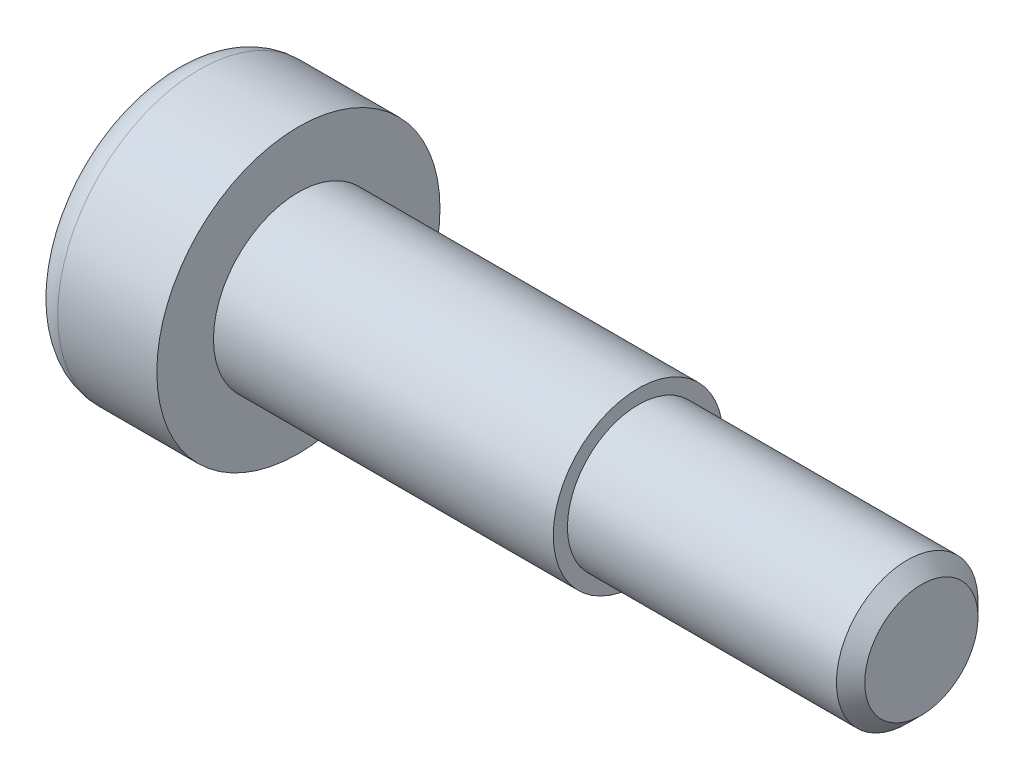
ISO-10303-21;
HEADER;
FILE_DESCRIPTION(('STEP AP214'),'2;1');
FILE_NAME('part.step','',(''),(''),'','','');
FILE_SCHEMA(('AUTOMOTIVE_DESIGN { 1 0 10303 214 1 1 1 1 }'));
ENDSEC;
DATA;
#1=APPLICATION_CONTEXT('core data for automotive mechanical design processes');
#2=APPLICATION_PROTOCOL_DEFINITION('international standard','automotive_design',2000,#1);
#3=PRODUCT_CONTEXT('',#1,'mechanical');
#4=PRODUCT('Part','Part','',(#3));
#5=PRODUCT_RELATED_PRODUCT_CATEGORY('part','',(#4));
#6=PRODUCT_DEFINITION_FORMATION('','',#4);
#7=PRODUCT_DEFINITION_CONTEXT('part definition',#1,'design');
#8=PRODUCT_DEFINITION('design','',#6,#7);
#9=PRODUCT_DEFINITION_SHAPE('','',#8);
#10=(LENGTH_UNIT() NAMED_UNIT(*) SI_UNIT(.MILLI.,.METRE.));
#11=(NAMED_UNIT(*) PLANE_ANGLE_UNIT() SI_UNIT($,.RADIAN.));
#12=(NAMED_UNIT(*) SI_UNIT($,.STERADIAN.) SOLID_ANGLE_UNIT());
#13=UNCERTAINTY_MEASURE_WITH_UNIT(LENGTH_MEASURE(1.E-05),#10,'distance_accuracy_value','');
#14=(GEOMETRIC_REPRESENTATION_CONTEXT(3) GLOBAL_UNCERTAINTY_ASSIGNED_CONTEXT((#13)) GLOBAL_UNIT_ASSIGNED_CONTEXT((#10,
#11,#12)) REPRESENTATION_CONTEXT('',''));
#15=CARTESIAN_POINT('',(0.,0.,0.));
#16=DIRECTION('',(0.,0.,1.));
#17=DIRECTION('',(1.,0.,0.));
#18=AXIS2_PLACEMENT_3D('',#15,#16,#17);
#19=CARTESIAN_POINT('',(0.,0.,0.));
#20=DIRECTION('',(1.,0.,0.));
#21=DIRECTION('',(0.,0.,-1.));
#22=AXIS2_PLACEMENT_3D('',#19,#20,#21);
#23=PLANE('',#22);
#24=CARTESIAN_POINT('',(0.,0.,0.));
#25=DIRECTION('',(1.,0.,0.));
#26=DIRECTION('',(0.,0.,-1.));
#27=AXIS2_PLACEMENT_3D('',#24,#25,#26);
#28=CIRCLE('',#27,4.);
#29=CARTESIAN_POINT('',(0.,0.,-4.));
#30=VERTEX_POINT('',#29);
#31=EDGE_CURVE('E156',#30,#30,#28,.F.);
#32=ORIENTED_EDGE('',*,*,#31,.T.);
#33=EDGE_LOOP('',(#32));
#34=FACE_BOUND('',#33,.T.);
#35=DIRECTION('',(0.,-0.5,-0.866025403784439));
#36=VECTOR('',#35,1.);
#37=CARTESIAN_POINT('',(0.,1.73205080756888,0.));
#38=LINE('',#37,#36);
#39=CARTESIAN_POINT('',(0.,1.73205080756888,0.));
#40=VERTEX_POINT('',#39);
#41=CARTESIAN_POINT('',(0.,0.866025403784439,-1.5));
#42=VERTEX_POINT('',#41);
#43=EDGE_CURVE('E126',#40,#42,#38,.T.);
#44=ORIENTED_EDGE('',*,*,#43,.F.);
#45=DIRECTION('',(0.,0.5,-0.866025403784439));
#46=VECTOR('',#45,1.);
#47=CARTESIAN_POINT('',(0.,0.86602540378444,1.5));
#48=LINE('',#47,#46);
#49=CARTESIAN_POINT('',(0.,0.86602540378444,1.5));
#50=VERTEX_POINT('',#49);
#51=EDGE_CURVE('E52',#50,#40,#48,.T.);
#52=ORIENTED_EDGE('',*,*,#51,.F.);
#53=DIRECTION('',(0.,1.,0.));
#54=VECTOR('',#53,1.);
#55=CARTESIAN_POINT('',(0.,-0.866025403784439,1.5));
#56=LINE('',#55,#54);
#57=CARTESIAN_POINT('',(0.,-0.866025403784439,1.5));
#58=VERTEX_POINT('',#57);
#59=EDGE_CURVE('E135',#58,#50,#56,.T.);
#60=ORIENTED_EDGE('',*,*,#59,.F.);
#61=DIRECTION('',(0.,0.5,0.866025403784439));
#62=VECTOR('',#61,1.);
#63=CARTESIAN_POINT('',(0.,-1.73205080756888,0.));
#64=LINE('',#63,#62);
#65=CARTESIAN_POINT('',(0.,-1.73205080756888,0.));
#66=VERTEX_POINT('',#65);
#67=EDGE_CURVE('E133',#66,#58,#64,.T.);
#68=ORIENTED_EDGE('',*,*,#67,.F.);
#69=DIRECTION('',(0.,-0.5,0.866025403784439));
#70=VECTOR('',#69,1.);
#71=CARTESIAN_POINT('',(0.,-0.866025403784439,-1.5));
#72=LINE('',#71,#70);
#73=CARTESIAN_POINT('',(0.,-0.866025403784439,-1.5));
#74=VERTEX_POINT('',#73);
#75=EDGE_CURVE('E100',#74,#66,#72,.T.);
#76=ORIENTED_EDGE('',*,*,#75,.F.);
#77=DIRECTION('',(0.,-1.,0.));
#78=VECTOR('',#77,1.);
#79=CARTESIAN_POINT('',(0.,0.866025403784439,-1.5));
#80=LINE('',#79,#78);
#81=EDGE_CURVE('E129',#42,#74,#80,.T.);
#82=ORIENTED_EDGE('',*,*,#81,.F.);
#83=EDGE_LOOP('',(#44,#52,#60,#68,#76,#82));
#84=FACE_BOUND('',#83,.T.);
#85=ADVANCED_FACE('F37',(#34,#84),#23,.F.);
#86=CARTESIAN_POINT('',(0.,0.,0.));
#87=DIRECTION('',(-1.,0.,0.));
#88=DIRECTION('',(0.,0.,1.));
#89=AXIS2_PLACEMENT_3D('',#86,#87,#88);
#90=CYLINDRICAL_SURFACE('',#89,5.);
#91=CARTESIAN_POINT('',(1.,0.,0.));
#92=DIRECTION('',(1.,0.,0.));
#93=DIRECTION('',(0.,0.,-1.));
#94=AXIS2_PLACEMENT_3D('',#91,#92,#93);
#95=CIRCLE('',#94,5.);
#96=CARTESIAN_POINT('',(1.,0.,-5.));
#97=VERTEX_POINT('',#96);
#98=EDGE_CURVE('E159',#97,#97,#95,.T.);
#99=ORIENTED_EDGE('',*,*,#98,.T.);
#100=EDGE_LOOP('',(#99));
#101=FACE_BOUND('',#100,.T.);
#102=CARTESIAN_POINT('',(4.5,0.,0.));
#103=DIRECTION('',(-1.,0.,0.));
#104=DIRECTION('',(0.,0.,1.));
#105=AXIS2_PLACEMENT_3D('',#102,#103,#104);
#106=CIRCLE('',#105,5.);
#107=CARTESIAN_POINT('',(4.5,0.,5.));
#108=VERTEX_POINT('',#107);
#109=EDGE_CURVE('E153',#108,#108,#106,.T.);
#110=ORIENTED_EDGE('',*,*,#109,.T.);
#111=EDGE_LOOP('',(#110));
#112=FACE_BOUND('',#111,.T.);
#113=ADVANCED_FACE('F176',(#101,#112),#90,.T.);
#114=CARTESIAN_POINT('',(4.5,5.,0.));
#115=DIRECTION('',(-1.,0.,0.));
#116=DIRECTION('',(0.,0.,1.));
#117=AXIS2_PLACEMENT_3D('',#114,#115,#116);
#118=PLANE('',#117);
#119=ORIENTED_EDGE('',*,*,#109,.F.);
#120=EDGE_LOOP('',(#119));
#121=FACE_BOUND('',#120,.T.);
#122=CARTESIAN_POINT('',(4.5,0.,0.));
#123=DIRECTION('',(-1.,0.,0.));
#124=DIRECTION('',(0.,0.,1.));
#125=AXIS2_PLACEMENT_3D('',#122,#123,#124);
#126=CIRCLE('',#125,3.);
#127=CARTESIAN_POINT('',(4.5,0.,3.));
#128=VERTEX_POINT('',#127);
#129=EDGE_CURVE('E150',#128,#128,#126,.T.);
#130=ORIENTED_EDGE('',*,*,#129,.T.);
#131=EDGE_LOOP('',(#130));
#132=FACE_BOUND('',#131,.T.);
#133=ADVANCED_FACE('F182',(#121,#132),#118,.F.);
#134=CARTESIAN_POINT('',(0.,0.,0.));
#135=DIRECTION('',(-1.,0.,0.));
#136=DIRECTION('',(0.,0.,1.));
#137=AXIS2_PLACEMENT_3D('',#134,#135,#136);
#138=CYLINDRICAL_SURFACE('',#137,3.);
#139=ORIENTED_EDGE('',*,*,#129,.F.);
#140=EDGE_LOOP('',(#139));
#141=FACE_BOUND('',#140,.T.);
#142=CARTESIAN_POINT('',(16.5,0.,0.));
#143=DIRECTION('',(-1.,0.,0.));
#144=DIRECTION('',(0.,0.,1.));
#145=AXIS2_PLACEMENT_3D('',#142,#143,#144);
#146=CIRCLE('',#145,3.);
#147=CARTESIAN_POINT('',(16.5,0.,3.));
#148=VERTEX_POINT('',#147);
#149=EDGE_CURVE('E147',#148,#148,#146,.T.);
#150=ORIENTED_EDGE('',*,*,#149,.T.);
#151=EDGE_LOOP('',(#150));
#152=FACE_BOUND('',#151,.T.);
#153=ADVANCED_FACE('F189',(#141,#152),#138,.T.);
#154=CARTESIAN_POINT('',(16.5,3.,0.));
#155=DIRECTION('',(-1.,0.,0.));
#156=DIRECTION('',(0.,0.,1.));
#157=AXIS2_PLACEMENT_3D('',#154,#155,#156);
#158=PLANE('',#157);
#159=ORIENTED_EDGE('',*,*,#149,.F.);
#160=EDGE_LOOP('',(#159));
#161=FACE_BOUND('',#160,.T.);
#162=CARTESIAN_POINT('',(16.5,0.,0.));
#163=DIRECTION('',(-1.,0.,0.));
#164=DIRECTION('',(0.,0.,1.));
#165=AXIS2_PLACEMENT_3D('',#162,#163,#164);
#166=CIRCLE('',#165,2.5);
#167=CARTESIAN_POINT('',(16.5,0.,2.5));
#168=VERTEX_POINT('',#167);
#169=EDGE_CURVE('E139',#168,#168,#166,.T.);
#170=ORIENTED_EDGE('',*,*,#169,.T.);
#171=EDGE_LOOP('',(#170));
#172=FACE_BOUND('',#171,.T.);
#173=ADVANCED_FACE('F193',(#161,#172),#158,.F.);
#174=CARTESIAN_POINT('',(0.,0.,0.));
#175=DIRECTION('',(-1.,0.,0.));
#176=DIRECTION('',(0.,0.,1.));
#177=AXIS2_PLACEMENT_3D('',#174,#175,#176);
#178=CYLINDRICAL_SURFACE('',#177,2.5);
#179=CARTESIAN_POINT('',(26.,0.,0.));
#180=DIRECTION('',(-1.,0.,0.));
#181=DIRECTION('',(0.,0.,1.));
#182=AXIS2_PLACEMENT_3D('',#179,#180,#181);
#183=CIRCLE('',#182,2.5);
#184=CARTESIAN_POINT('',(26.,0.,2.5));
#185=VERTEX_POINT('',#184);
#186=EDGE_CURVE('E45',#185,#185,#183,.T.);
#187=ORIENTED_EDGE('',*,*,#186,.T.);
#188=EDGE_LOOP('',(#187));
#189=FACE_BOUND('',#188,.T.);
#190=ORIENTED_EDGE('',*,*,#169,.F.);
#191=EDGE_LOOP('',(#190));
#192=FACE_BOUND('',#191,.T.);
#193=ADVANCED_FACE('F164',(#189,#192),#178,.T.);
#194=CARTESIAN_POINT('',(26.5,2.5,0.));
#195=DIRECTION('',(-1.,0.,0.));
#196=DIRECTION('',(0.,0.,1.));
#197=AXIS2_PLACEMENT_3D('',#194,#195,#196);
#198=PLANE('',#197);
#199=CARTESIAN_POINT('',(26.5,0.,0.));
#200=DIRECTION('',(-1.,0.,0.));
#201=DIRECTION('',(0.,0.,1.));
#202=AXIS2_PLACEMENT_3D('',#199,#200,#201);
#203=CIRCLE('',#202,1.99999999999999);
#204=CARTESIAN_POINT('',(26.5,0.,1.99999999999999));
#205=VERTEX_POINT('',#204);
#206=EDGE_CURVE('E11',#205,#205,#203,.F.);
#207=ORIENTED_EDGE('',*,*,#206,.T.);
#208=EDGE_LOOP('',(#207));
#209=FACE_BOUND('',#208,.T.);
#210=ADVANCED_FACE('F200',(#209),#198,.F.);
#211=CARTESIAN_POINT('',(3.,0.86602540378444,1.5));
#212=DIRECTION('',(0.,0.866025403784439,0.5));
#213=DIRECTION('',(0.,-0.5,0.866025403784439));
#214=AXIS2_PLACEMENT_3D('',#211,#212,#213);
#215=PLANE('',#214);
#216=ORIENTED_EDGE('',*,*,#51,.T.);
#217=DIRECTION('',(-1.,0.,0.));
#218=VECTOR('',#217,1.);
#219=CARTESIAN_POINT('',(3.,1.73205080756888,0.));
#220=LINE('',#219,#218);
#221=CARTESIAN_POINT('',(3.,1.73205080756888,0.));
#222=VERTEX_POINT('',#221);
#223=EDGE_CURVE('E82',#222,#40,#220,.T.);
#224=ORIENTED_EDGE('',*,*,#223,.F.);
#225=DIRECTION('',(0.,0.5,-0.866025403784439));
#226=VECTOR('',#225,1.);
#227=CARTESIAN_POINT('',(3.,0.86602540378444,1.5));
#228=LINE('',#227,#226);
#229=CARTESIAN_POINT('',(3.,0.86602540378444,1.5));
#230=VERTEX_POINT('',#229);
#231=EDGE_CURVE('E137',#230,#222,#228,.T.);
#232=ORIENTED_EDGE('',*,*,#231,.F.);
#233=DIRECTION('',(-1.,0.,0.));
#234=VECTOR('',#233,1.);
#235=CARTESIAN_POINT('',(3.,0.86602540378444,1.5));
#236=LINE('',#235,#234);
#237=EDGE_CURVE('E60',#230,#50,#236,.T.);
#238=ORIENTED_EDGE('',*,*,#237,.T.);
#239=EDGE_LOOP('',(#216,#224,#232,#238));
#240=FACE_BOUND('',#239,.T.);
#241=ADVANCED_FACE('F203',(#240),#215,.F.);
#242=CARTESIAN_POINT('',(3.,-0.866025403784439,1.5));
#243=DIRECTION('',(0.,0.,1.));
#244=DIRECTION('',(1.,0.,0.));
#245=AXIS2_PLACEMENT_3D('',#242,#243,#244);
#246=PLANE('',#245);
#247=ORIENTED_EDGE('',*,*,#59,.T.);
#248=ORIENTED_EDGE('',*,*,#237,.F.);
#249=DIRECTION('',(0.,1.,0.));
#250=VECTOR('',#249,1.);
#251=CARTESIAN_POINT('',(3.,-0.866025403784439,1.5));
#252=LINE('',#251,#250);
#253=CARTESIAN_POINT('',(3.,-0.866025403784439,1.5));
#254=VERTEX_POINT('',#253);
#255=EDGE_CURVE('E112',#254,#230,#252,.T.);
#256=ORIENTED_EDGE('',*,*,#255,.F.);
#257=DIRECTION('',(-1.,0.,0.));
#258=VECTOR('',#257,1.);
#259=CARTESIAN_POINT('',(3.,-0.866025403784439,1.5));
#260=LINE('',#259,#258);
#261=EDGE_CURVE('E104',#254,#58,#260,.T.);
#262=ORIENTED_EDGE('',*,*,#261,.T.);
#263=EDGE_LOOP('',(#247,#248,#256,#262));
#264=FACE_BOUND('',#263,.T.);
#265=ADVANCED_FACE('F207',(#264),#246,.F.);
#266=CARTESIAN_POINT('',(3.,-1.73205080756888,0.));
#267=DIRECTION('',(0.,-0.866025403784439,0.5));
#268=DIRECTION('',(0.,-0.5,-0.866025403784439));
#269=AXIS2_PLACEMENT_3D('',#266,#267,#268);
#270=PLANE('',#269);
#271=ORIENTED_EDGE('',*,*,#67,.T.);
#272=ORIENTED_EDGE('',*,*,#261,.F.);
#273=DIRECTION('',(0.,0.5,0.866025403784439));
#274=VECTOR('',#273,1.);
#275=CARTESIAN_POINT('',(3.,-1.73205080756888,0.));
#276=LINE('',#275,#274);
#277=CARTESIAN_POINT('',(3.,-1.73205080756888,0.));
#278=VERTEX_POINT('',#277);
#279=EDGE_CURVE('E108',#278,#254,#276,.T.);
#280=ORIENTED_EDGE('',*,*,#279,.F.);
#281=DIRECTION('',(-1.,0.,0.));
#282=VECTOR('',#281,1.);
#283=CARTESIAN_POINT('',(3.,-1.73205080756888,0.));
#284=LINE('',#283,#282);
#285=EDGE_CURVE('E93',#278,#66,#284,.T.);
#286=ORIENTED_EDGE('',*,*,#285,.T.);
#287=EDGE_LOOP('',(#271,#272,#280,#286));
#288=FACE_BOUND('',#287,.T.);
#289=ADVANCED_FACE('F109',(#288),#270,.F.);
#290=CARTESIAN_POINT('',(3.,-0.866025403784439,-1.5));
#291=DIRECTION('',(0.,-0.866025403784438,-0.5));
#292=DIRECTION('',(0.,0.5,-0.866025403784439));
#293=AXIS2_PLACEMENT_3D('',#290,#291,#292);
#294=PLANE('',#293);
#295=ORIENTED_EDGE('',*,*,#75,.T.);
#296=ORIENTED_EDGE('',*,*,#285,.F.);
#297=DIRECTION('',(0.,-0.5,0.866025403784439));
#298=VECTOR('',#297,1.);
#299=CARTESIAN_POINT('',(3.,-0.866025403784439,-1.5));
#300=LINE('',#299,#298);
#301=CARTESIAN_POINT('',(3.,-0.866025403784439,-1.5));
#302=VERTEX_POINT('',#301);
#303=EDGE_CURVE('E97',#302,#278,#300,.T.);
#304=ORIENTED_EDGE('',*,*,#303,.F.);
#305=DIRECTION('',(-1.,0.,0.));
#306=VECTOR('',#305,1.);
#307=CARTESIAN_POINT('',(3.,-0.866025403784439,-1.5));
#308=LINE('',#307,#306);
#309=EDGE_CURVE('E105',#302,#74,#308,.T.);
#310=ORIENTED_EDGE('',*,*,#309,.T.);
#311=EDGE_LOOP('',(#295,#296,#304,#310));
#312=FACE_BOUND('',#311,.T.);
#313=ADVANCED_FACE('F95',(#312),#294,.F.);
#314=CARTESIAN_POINT('',(3.,0.866025403784439,-1.5));
#315=DIRECTION('',(0.,0.,-1.));
#316=DIRECTION('',(-1.,0.,0.));
#317=AXIS2_PLACEMENT_3D('',#314,#315,#316);
#318=PLANE('',#317);
#319=ORIENTED_EDGE('',*,*,#81,.T.);
#320=ORIENTED_EDGE('',*,*,#309,.F.);
#321=DIRECTION('',(0.,-1.,0.));
#322=VECTOR('',#321,1.);
#323=CARTESIAN_POINT('',(3.,0.866025403784439,-1.5));
#324=LINE('',#323,#322);
#325=CARTESIAN_POINT('',(3.,0.866025403784439,-1.5));
#326=VERTEX_POINT('',#325);
#327=EDGE_CURVE('E118',#326,#302,#324,.T.);
#328=ORIENTED_EDGE('',*,*,#327,.F.);
#329=DIRECTION('',(-1.,0.,0.));
#330=VECTOR('',#329,1.);
#331=CARTESIAN_POINT('',(3.,0.866025403784439,-1.5));
#332=LINE('',#331,#330);
#333=EDGE_CURVE('E142',#326,#42,#332,.T.);
#334=ORIENTED_EDGE('',*,*,#333,.T.);
#335=EDGE_LOOP('',(#319,#320,#328,#334));
#336=FACE_BOUND('',#335,.T.);
#337=ADVANCED_FACE('F211',(#336),#318,.F.);
#338=CARTESIAN_POINT('',(3.,1.73205080756888,0.));
#339=DIRECTION('',(0.,0.866025403784439,-0.5));
#340=DIRECTION('',(0.,0.5,0.866025403784439));
#341=AXIS2_PLACEMENT_3D('',#338,#339,#340);
#342=PLANE('',#341);
#343=ORIENTED_EDGE('',*,*,#43,.T.);
#344=ORIENTED_EDGE('',*,*,#333,.F.);
#345=DIRECTION('',(0.,-0.5,-0.866025403784439));
#346=VECTOR('',#345,1.);
#347=CARTESIAN_POINT('',(3.,1.73205080756888,0.));
#348=LINE('',#347,#346);
#349=EDGE_CURVE('E120',#222,#326,#348,.T.);
#350=ORIENTED_EDGE('',*,*,#349,.F.);
#351=ORIENTED_EDGE('',*,*,#223,.T.);
#352=EDGE_LOOP('',(#343,#344,#350,#351));
#353=FACE_BOUND('',#352,.T.);
#354=ADVANCED_FACE('F208',(#353),#342,.F.);
#355=CARTESIAN_POINT('',(3.,0.,0.));
#356=DIRECTION('',(-1.,0.,0.));
#357=DIRECTION('',(0.,0.,1.));
#358=AXIS2_PLACEMENT_3D('',#355,#356,#357);
#359=PLANE('',#358);
#360=ORIENTED_EDGE('',*,*,#231,.T.);
#361=ORIENTED_EDGE('',*,*,#349,.T.);
#362=ORIENTED_EDGE('',*,*,#327,.T.);
#363=ORIENTED_EDGE('',*,*,#303,.T.);
#364=ORIENTED_EDGE('',*,*,#279,.T.);
#365=ORIENTED_EDGE('',*,*,#255,.T.);
#366=EDGE_LOOP('',(#360,#361,#362,#363,#364,#365));
#367=FACE_BOUND('',#366,.T.);
#368=ADVANCED_FACE('F115',(#367),#359,.T.);
#369=CARTESIAN_POINT('',(1.,0.,0.));
#370=DIRECTION('',(1.,0.,0.));
#371=DIRECTION('',(0.,0.,-1.));
#372=AXIS2_PLACEMENT_3D('',#369,#370,#371);
#373=TOROIDAL_SURFACE('',#372,4.,1.);
#374=ORIENTED_EDGE('',*,*,#98,.F.);
#375=EDGE_LOOP('',(#374));
#376=FACE_BOUND('',#375,.T.);
#377=ORIENTED_EDGE('',*,*,#31,.F.);
#378=EDGE_LOOP('',(#377));
#379=FACE_BOUND('',#378,.T.);
#380=ADVANCED_FACE('F168',(#376,#379),#373,.T.);
#381=CARTESIAN_POINT('',(26.,0.,0.));
#382=DIRECTION('',(-1.,0.,0.));
#383=DIRECTION('',(0.,0.,1.));
#384=AXIS2_PLACEMENT_3D('',#381,#382,#383);
#385=CONICAL_SURFACE('',#384,2.5,0.785398163397453);
#386=ORIENTED_EDGE('',*,*,#206,.F.);
#387=EDGE_LOOP('',(#386));
#388=FACE_BOUND('',#387,.T.);
#389=ORIENTED_EDGE('',*,*,#186,.F.);
#390=EDGE_LOOP('',(#389));
#391=FACE_BOUND('',#390,.T.);
#392=ADVANCED_FACE('F39',(#388,#391),#385,.T.);
#393=CLOSED_SHELL('',(#85,#113,#133,#153,#173,#193,#210,#241,#265,#289,#313,#337,#354,#368,#380,#392));
#394=MANIFOLD_SOLID_BREP('B2',#393);
#395=ADVANCED_BREP_SHAPE_REPRESENTATION('',(#18,#394),#14);
#396=SHAPE_DEFINITION_REPRESENTATION(#9,#395);
ENDSEC;
END-ISO-10303-21;
